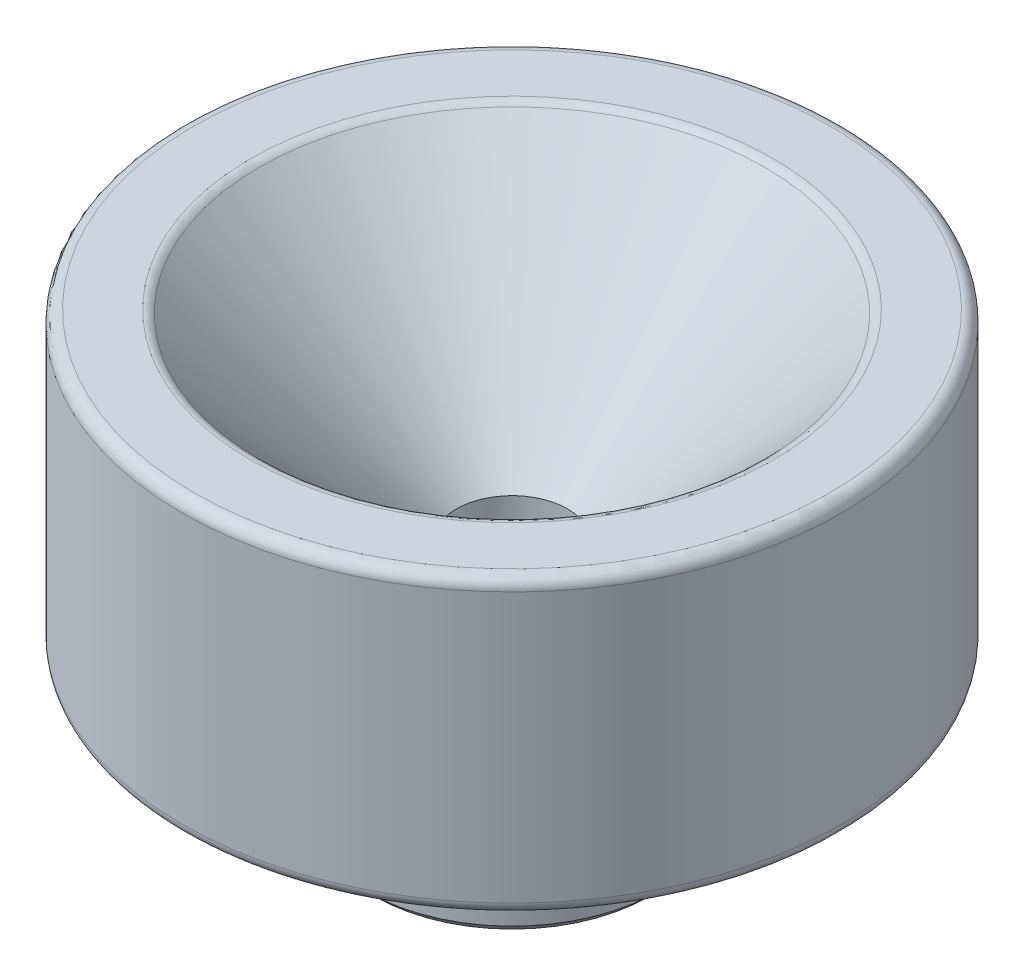
ISO-10303-21;
HEADER;
FILE_DESCRIPTION(('STEP AP214'),'2;1');
FILE_NAME('part.step','',(''),(''),'','','');
FILE_SCHEMA(('AUTOMOTIVE_DESIGN { 1 0 10303 214 1 1 1 1 }'));
ENDSEC;
DATA;
#1=APPLICATION_CONTEXT('core data for automotive mechanical design processes');
#2=APPLICATION_PROTOCOL_DEFINITION('international standard','automotive_design',2000,#1);
#3=PRODUCT_CONTEXT('',#1,'mechanical');
#4=PRODUCT('Part','Part','',(#3));
#5=PRODUCT_RELATED_PRODUCT_CATEGORY('part','',(#4));
#6=PRODUCT_DEFINITION_FORMATION('','',#4);
#7=PRODUCT_DEFINITION_CONTEXT('part definition',#1,'design');
#8=PRODUCT_DEFINITION('design','',#6,#7);
#9=PRODUCT_DEFINITION_SHAPE('','',#8);
#10=(LENGTH_UNIT() NAMED_UNIT(*) SI_UNIT(.MILLI.,.METRE.));
#11=(NAMED_UNIT(*) PLANE_ANGLE_UNIT() SI_UNIT($,.RADIAN.));
#12=(NAMED_UNIT(*) SI_UNIT($,.STERADIAN.) SOLID_ANGLE_UNIT());
#13=UNCERTAINTY_MEASURE_WITH_UNIT(LENGTH_MEASURE(1.E-05),#10,'distance_accuracy_value','');
#14=(GEOMETRIC_REPRESENTATION_CONTEXT(3) GLOBAL_UNCERTAINTY_ASSIGNED_CONTEXT((#13)) GLOBAL_UNIT_ASSIGNED_CONTEXT((#10,
#11,#12)) REPRESENTATION_CONTEXT('',''));
#15=CARTESIAN_POINT('',(0.,0.,0.));
#16=DIRECTION('',(0.,0.,1.));
#17=DIRECTION('',(1.,0.,0.));
#18=AXIS2_PLACEMENT_3D('',#15,#16,#17);
#19=CARTESIAN_POINT('',(0.,0.,0.));
#20=DIRECTION('',(0.,-1.,0.));
#21=DIRECTION('',(0.,0.,-1.));
#22=AXIS2_PLACEMENT_3D('',#19,#20,#21);
#23=CYLINDRICAL_SURFACE('',#22,6.35);
#24=CARTESIAN_POINT('',(0.,-5.969,0.));
#25=DIRECTION('',(0.,-1.,0.));
#26=DIRECTION('',(0.,0.,-1.));
#27=AXIS2_PLACEMENT_3D('',#24,#25,#26);
#28=CIRCLE('',#27,6.35);
#29=CARTESIAN_POINT('',(0.,-5.969,-6.35));
#30=VERTEX_POINT('',#29);
#31=EDGE_CURVE('E12',#30,#30,#28,.F.);
#32=ORIENTED_EDGE('',*,*,#31,.T.);
#33=EDGE_LOOP('',(#32));
#34=FACE_BOUND('',#33,.T.);
#35=CARTESIAN_POINT('',(0.,-1.07596126628495,0.));
#36=DIRECTION('',(0.,1.,0.));
#37=DIRECTION('',(0.,0.,1.));
#38=AXIS2_PLACEMENT_3D('',#35,#36,#37);
#39=CIRCLE('',#38,6.35);
#40=CARTESIAN_POINT('',(0.,-1.07596126628495,6.35));
#41=VERTEX_POINT('',#40);
#42=EDGE_CURVE('E82',#41,#41,#39,.F.);
#43=ORIENTED_EDGE('',*,*,#42,.T.);
#44=EDGE_LOOP('',(#43));
#45=FACE_BOUND('',#44,.T.);
#46=ADVANCED_FACE('F41',(#34,#45),#23,.T.);
#47=CARTESIAN_POINT('',(6.35,0.,0.));
#48=DIRECTION('',(0.,-1.,0.));
#49=DIRECTION('',(0.,0.,-1.));
#50=AXIS2_PLACEMENT_3D('',#47,#48,#49);
#51=PLANE('',#50);
#52=CARTESIAN_POINT('',(0.,0.,0.));
#53=DIRECTION('',(0.,-1.,0.));
#54=DIRECTION('',(0.,0.,-1.));
#55=AXIS2_PLACEMENT_3D('',#52,#53,#54);
#56=CIRCLE('',#55,13.7795);
#57=CARTESIAN_POINT('',(0.,0.,-13.7795));
#58=VERTEX_POINT('',#57);
#59=EDGE_CURVE('E69',#58,#58,#56,.T.);
#60=ORIENTED_EDGE('',*,*,#59,.T.);
#61=EDGE_LOOP('',(#60));
#62=FACE_BOUND('',#61,.T.);
#63=CARTESIAN_POINT('',(0.,0.,0.));
#64=DIRECTION('',(0.,-1.,0.));
#65=DIRECTION('',(0.,0.,-1.));
#66=AXIS2_PLACEMENT_3D('',#63,#64,#65);
#67=CIRCLE('',#66,7.42596126628495);
#68=CARTESIAN_POINT('',(0.,0.,-7.42596126628495));
#69=VERTEX_POINT('',#68);
#70=EDGE_CURVE('E79',#69,#69,#67,.F.);
#71=ORIENTED_EDGE('',*,*,#70,.T.);
#72=EDGE_LOOP('',(#71));
#73=FACE_BOUND('',#72,.T.);
#74=ADVANCED_FACE('F97',(#62,#73),#51,.T.);
#75=CARTESIAN_POINT('',(2.413,-6.35,0.));
#76=DIRECTION('',(0.,-1.,0.));
#77=DIRECTION('',(0.,0.,-1.));
#78=AXIS2_PLACEMENT_3D('',#75,#76,#77);
#79=PLANE('',#78);
#80=CARTESIAN_POINT('',(0.,-6.35,0.));
#81=DIRECTION('',(0.,-1.,0.));
#82=DIRECTION('',(0.,0.,-1.));
#83=AXIS2_PLACEMENT_3D('',#80,#81,#82);
#84=CIRCLE('',#83,5.96900000000001);
#85=CARTESIAN_POINT('',(0.,-6.35,-5.96900000000001));
#86=VERTEX_POINT('',#85);
#87=EDGE_CURVE('E47',#86,#86,#84,.T.);
#88=ORIENTED_EDGE('',*,*,#87,.T.);
#89=EDGE_LOOP('',(#88));
#90=FACE_BOUND('',#89,.T.);
#91=CARTESIAN_POINT('',(0.,-6.35,0.));
#92=DIRECTION('',(0.,-1.,0.));
#93=DIRECTION('',(0.,0.,-1.));
#94=AXIS2_PLACEMENT_3D('',#91,#92,#93);
#95=CIRCLE('',#94,2.79399999999999);
#96=CARTESIAN_POINT('',(0.,-6.35,-2.79399999999999));
#97=VERTEX_POINT('',#96);
#98=EDGE_CURVE('E72',#97,#97,#95,.F.);
#99=ORIENTED_EDGE('',*,*,#98,.T.);
#100=EDGE_LOOP('',(#99));
#101=FACE_BOUND('',#100,.T.);
#102=ADVANCED_FACE('F99',(#90,#101),#79,.T.);
#103=CARTESIAN_POINT('',(0.,0.,0.));
#104=DIRECTION('',(0.,-1.,0.));
#105=DIRECTION('',(0.,0.,-1.));
#106=AXIS2_PLACEMENT_3D('',#103,#104,#105);
#107=CYLINDRICAL_SURFACE('',#106,2.413);
#108=CARTESIAN_POINT('',(0.,-5.96900000000001,0.));
#109=DIRECTION('',(0.,-1.,0.));
#110=DIRECTION('',(0.,0.,-1.));
#111=AXIS2_PLACEMENT_3D('',#108,#109,#110);
#112=CIRCLE('',#111,2.413);
#113=CARTESIAN_POINT('',(0.,-5.96900000000001,-2.413));
#114=VERTEX_POINT('',#113);
#115=EDGE_CURVE('E75',#114,#114,#112,.T.);
#116=ORIENTED_EDGE('',*,*,#115,.T.);
#117=EDGE_LOOP('',(#116));
#118=FACE_BOUND('',#117,.T.);
#119=CARTESIAN_POINT('',(0.,4.00049999999991,0.));
#120=DIRECTION('',(0.,-1.,0.));
#121=DIRECTION('',(0.,0.,-1.));
#122=AXIS2_PLACEMENT_3D('',#119,#120,#121);
#123=CIRCLE('',#122,2.413);
#124=CARTESIAN_POINT('',(0.,4.00049999999991,-2.413));
#125=VERTEX_POINT('',#124);
#126=EDGE_CURVE('E78',#125,#125,#123,.T.);
#127=ORIENTED_EDGE('',*,*,#126,.F.);
#128=EDGE_LOOP('',(#127));
#129=FACE_BOUND('',#128,.T.);
#130=ADVANCED_FACE('F106',(#118,#129),#107,.F.);
#131=CARTESIAN_POINT('',(0.,12.7,0.));
#132=DIRECTION('',(0.,1.,0.));
#133=DIRECTION('',(0.,0.,1.));
#134=AXIS2_PLACEMENT_3D('',#131,#132,#133);
#135=CONICAL_SURFACE('',#134,11.1125,0.785398163397443);
#136=CARTESIAN_POINT('',(0.,12.5512102448428,0.));
#137=DIRECTION('',(0.,-1.,0.));
#138=DIRECTION('',(0.,0.,-1.));
#139=AXIS2_PLACEMENT_3D('',#136,#137,#138);
#140=CIRCLE('',#139,10.9637102448428);
#141=CARTESIAN_POINT('',(0.,12.5512102448428,-10.9637102448428));
#142=VERTEX_POINT('',#141);
#143=EDGE_CURVE('E51',#142,#142,#140,.F.);
#144=ORIENTED_EDGE('',*,*,#143,.T.);
#145=EDGE_LOOP('',(#144));
#146=FACE_BOUND('',#145,.T.);
#147=ORIENTED_EDGE('',*,*,#126,.T.);
#148=EDGE_LOOP('',(#147));
#149=FACE_BOUND('',#148,.T.);
#150=ADVANCED_FACE('F115',(#146,#149),#135,.F.);
#151=CARTESIAN_POINT('',(14.2875,12.7,0.));
#152=DIRECTION('',(0.,1.,0.));
#153=DIRECTION('',(0.,0.,1.));
#154=AXIS2_PLACEMENT_3D('',#151,#152,#153);
#155=PLANE('',#154);
#156=CARTESIAN_POINT('',(0.,12.7,0.));
#157=DIRECTION('',(0.,1.,0.));
#158=DIRECTION('',(0.,0.,1.));
#159=AXIS2_PLACEMENT_3D('',#156,#157,#158);
#160=CIRCLE('',#159,13.7795);
#161=CARTESIAN_POINT('',(0.,12.7,13.7795));
#162=VERTEX_POINT('',#161);
#163=EDGE_CURVE('E55',#162,#162,#160,.T.);
#164=ORIENTED_EDGE('',*,*,#163,.T.);
#165=EDGE_LOOP('',(#164));
#166=FACE_BOUND('',#165,.T.);
#167=CARTESIAN_POINT('',(0.,12.7,0.));
#168=DIRECTION('',(0.,1.,0.));
#169=DIRECTION('',(0.,0.,1.));
#170=AXIS2_PLACEMENT_3D('',#167,#168,#169);
#171=CIRCLE('',#170,11.3229204896855);
#172=CARTESIAN_POINT('',(0.,12.7,11.3229204896855));
#173=VERTEX_POINT('',#172);
#174=EDGE_CURVE('E60',#173,#173,#171,.F.);
#175=ORIENTED_EDGE('',*,*,#174,.T.);
#176=EDGE_LOOP('',(#175));
#177=FACE_BOUND('',#176,.T.);
#178=ADVANCED_FACE('F111',(#166,#177),#155,.T.);
#179=CARTESIAN_POINT('',(0.,0.,0.));
#180=DIRECTION('',(0.,-1.,0.));
#181=DIRECTION('',(0.,0.,-1.));
#182=AXIS2_PLACEMENT_3D('',#179,#180,#181);
#183=CYLINDRICAL_SURFACE('',#182,14.2875);
#184=CARTESIAN_POINT('',(0.,0.508,0.));
#185=DIRECTION('',(0.,-1.,0.));
#186=DIRECTION('',(0.,0.,-1.));
#187=AXIS2_PLACEMENT_3D('',#184,#185,#186);
#188=CIRCLE('',#187,14.2875);
#189=CARTESIAN_POINT('',(0.,0.508,-14.2875));
#190=VERTEX_POINT('',#189);
#191=EDGE_CURVE('E63',#190,#190,#188,.F.);
#192=ORIENTED_EDGE('',*,*,#191,.T.);
#193=EDGE_LOOP('',(#192));
#194=FACE_BOUND('',#193,.T.);
#195=CARTESIAN_POINT('',(0.,12.192,0.));
#196=DIRECTION('',(0.,1.,0.));
#197=DIRECTION('',(0.,0.,1.));
#198=AXIS2_PLACEMENT_3D('',#195,#196,#197);
#199=CIRCLE('',#198,14.2875);
#200=CARTESIAN_POINT('',(0.,12.192,14.2875));
#201=VERTEX_POINT('',#200);
#202=EDGE_CURVE('E66',#201,#201,#199,.F.);
#203=ORIENTED_EDGE('',*,*,#202,.T.);
#204=EDGE_LOOP('',(#203));
#205=FACE_BOUND('',#204,.T.);
#206=ADVANCED_FACE('F93',(#194,#205),#183,.T.);
#207=CARTESIAN_POINT('',(0.,-0.508,0.));
#208=DIRECTION('',(0.,1.,0.));
#209=DIRECTION('',(0.,0.,1.));
#210=AXIS2_PLACEMENT_3D('',#207,#208,#209);
#211=TOROIDAL_SURFACE('',#210,6.858,0.762000000000001);
#212=ORIENTED_EDGE('',*,*,#42,.F.);
#213=EDGE_LOOP('',(#212));
#214=FACE_BOUND('',#213,.T.);
#215=ORIENTED_EDGE('',*,*,#70,.F.);
#216=EDGE_LOOP('',(#215));
#217=FACE_BOUND('',#216,.T.);
#218=ADVANCED_FACE('F89',(#214,#217),#211,.F.);
#219=CARTESIAN_POINT('',(0.,-5.96900000000001,0.));
#220=DIRECTION('',(0.,-1.,0.));
#221=DIRECTION('',(0.,0.,-1.));
#222=AXIS2_PLACEMENT_3D('',#219,#220,#221);
#223=CONICAL_SURFACE('',#222,2.413,0.785398163397449);
#224=ORIENTED_EDGE('',*,*,#98,.F.);
#225=EDGE_LOOP('',(#224));
#226=FACE_BOUND('',#225,.T.);
#227=ORIENTED_EDGE('',*,*,#115,.F.);
#228=EDGE_LOOP('',(#227));
#229=FACE_BOUND('',#228,.T.);
#230=ADVANCED_FACE('F92',(#226,#229),#223,.F.);
#231=CARTESIAN_POINT('',(0.,0.508,0.));
#232=DIRECTION('',(0.,-1.,0.));
#233=DIRECTION('',(0.,0.,-1.));
#234=AXIS2_PLACEMENT_3D('',#231,#232,#233);
#235=TOROIDAL_SURFACE('',#234,13.7795,0.508);
#236=ORIENTED_EDGE('',*,*,#191,.F.);
#237=EDGE_LOOP('',(#236));
#238=FACE_BOUND('',#237,.T.);
#239=ORIENTED_EDGE('',*,*,#59,.F.);
#240=EDGE_LOOP('',(#239));
#241=FACE_BOUND('',#240,.T.);
#242=ADVANCED_FACE('F130',(#238,#241),#235,.T.);
#243=CARTESIAN_POINT('',(0.,12.192,0.));
#244=DIRECTION('',(0.,1.,0.));
#245=DIRECTION('',(0.,0.,1.));
#246=AXIS2_PLACEMENT_3D('',#243,#244,#245);
#247=TOROIDAL_SURFACE('',#246,13.7795,0.508);
#248=ORIENTED_EDGE('',*,*,#163,.F.);
#249=EDGE_LOOP('',(#248));
#250=FACE_BOUND('',#249,.T.);
#251=ORIENTED_EDGE('',*,*,#202,.F.);
#252=EDGE_LOOP('',(#251));
#253=FACE_BOUND('',#252,.T.);
#254=ADVANCED_FACE('F135',(#250,#253),#247,.T.);
#255=CARTESIAN_POINT('',(0.,12.192,0.));
#256=DIRECTION('',(0.,1.,0.));
#257=DIRECTION('',(0.,0.,1.));
#258=AXIS2_PLACEMENT_3D('',#255,#256,#257);
#259=TOROIDAL_SURFACE('',#258,11.3229204896855,0.508);
#260=ORIENTED_EDGE('',*,*,#143,.F.);
#261=EDGE_LOOP('',(#260));
#262=FACE_BOUND('',#261,.T.);
#263=ORIENTED_EDGE('',*,*,#174,.F.);
#264=EDGE_LOOP('',(#263));
#265=FACE_BOUND('',#264,.T.);
#266=ADVANCED_FACE('F142',(#262,#265),#259,.T.);
#267=CARTESIAN_POINT('',(0.,-6.35,0.));
#268=DIRECTION('',(0.,1.,0.));
#269=DIRECTION('',(0.,0.,1.));
#270=AXIS2_PLACEMENT_3D('',#267,#268,#269);
#271=CONICAL_SURFACE('',#270,5.96900000000001,0.785398163397439);
#272=ORIENTED_EDGE('',*,*,#31,.F.);
#273=EDGE_LOOP('',(#272));
#274=FACE_BOUND('',#273,.T.);
#275=ORIENTED_EDGE('',*,*,#87,.F.);
#276=EDGE_LOOP('',(#275));
#277=FACE_BOUND('',#276,.T.);
#278=ADVANCED_FACE('F146',(#274,#277),#271,.T.);
#279=CLOSED_SHELL('',(#46,#74,#102,#130,#150,#178,#206,#218,#230,#242,#254,#266,#278));
#280=MANIFOLD_SOLID_BREP('B2',#279);
#281=ADVANCED_BREP_SHAPE_REPRESENTATION('',(#18,#280),#14);
#282=SHAPE_DEFINITION_REPRESENTATION(#9,#281);
ENDSEC;
END-ISO-10303-21;
